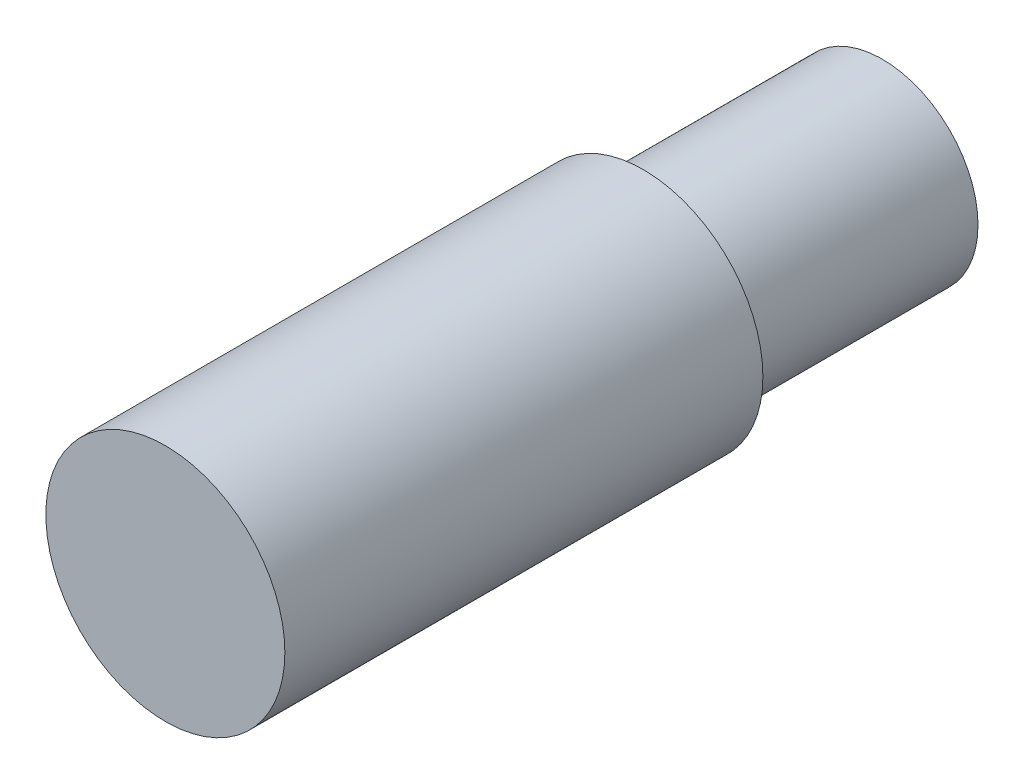
ISO-10303-21;
HEADER;
FILE_DESCRIPTION(('STEP AP214'),'2;1');
FILE_NAME('part.step','',(''),(''),'','','');
FILE_SCHEMA(('AUTOMOTIVE_DESIGN { 1 0 10303 214 1 1 1 1 }'));
ENDSEC;
DATA;
#1=APPLICATION_CONTEXT('core data for automotive mechanical design processes');
#2=APPLICATION_PROTOCOL_DEFINITION('international standard','automotive_design',2000,#1);
#3=PRODUCT_CONTEXT('',#1,'mechanical');
#4=PRODUCT('Part','Part','',(#3));
#5=PRODUCT_RELATED_PRODUCT_CATEGORY('part','',(#4));
#6=PRODUCT_DEFINITION_FORMATION('','',#4);
#7=PRODUCT_DEFINITION_CONTEXT('part definition',#1,'design');
#8=PRODUCT_DEFINITION('design','',#6,#7);
#9=PRODUCT_DEFINITION_SHAPE('','',#8);
#10=(LENGTH_UNIT() NAMED_UNIT(*) SI_UNIT(.MILLI.,.METRE.));
#11=(NAMED_UNIT(*) PLANE_ANGLE_UNIT() SI_UNIT($,.RADIAN.));
#12=(NAMED_UNIT(*) SI_UNIT($,.STERADIAN.) SOLID_ANGLE_UNIT());
#13=UNCERTAINTY_MEASURE_WITH_UNIT(LENGTH_MEASURE(1.E-05),#10,'distance_accuracy_value','');
#14=(GEOMETRIC_REPRESENTATION_CONTEXT(3) GLOBAL_UNCERTAINTY_ASSIGNED_CONTEXT((#13)) GLOBAL_UNIT_ASSIGNED_CONTEXT((#10,
#11,#12)) REPRESENTATION_CONTEXT('',''));
#15=CARTESIAN_POINT('',(0.,0.,0.));
#16=DIRECTION('',(0.,0.,1.));
#17=DIRECTION('',(1.,0.,0.));
#18=AXIS2_PLACEMENT_3D('',#15,#16,#17);
#19=CARTESIAN_POINT('',(0.,0.,5.));
#20=DIRECTION('',(0.,0.,-1.));
#21=DIRECTION('',(-1.,0.,0.));
#22=AXIS2_PLACEMENT_3D('',#19,#20,#21);
#23=CYLINDRICAL_SURFACE('',#22,2.);
#24=CARTESIAN_POINT('',(0.,0.,5.));
#25=DIRECTION('',(0.,0.,1.));
#26=DIRECTION('',(1.,0.,0.));
#27=AXIS2_PLACEMENT_3D('',#24,#25,#26);
#28=CIRCLE('',#27,2.);
#29=CARTESIAN_POINT('',(2.,0.,5.));
#30=VERTEX_POINT('',#29);
#31=EDGE_CURVE('E10',#30,#30,#28,.T.);
#32=ORIENTED_EDGE('',*,*,#31,.F.);
#33=EDGE_LOOP('',(#32));
#34=FACE_BOUND('',#33,.T.);
#35=CARTESIAN_POINT('',(0.,0.,0.));
#36=DIRECTION('',(0.,0.,1.));
#37=DIRECTION('',(1.,0.,0.));
#38=AXIS2_PLACEMENT_3D('',#35,#36,#37);
#39=CIRCLE('',#38,2.);
#40=CARTESIAN_POINT('',(2.,0.,0.));
#41=VERTEX_POINT('',#40);
#42=EDGE_CURVE('E31',#41,#41,#39,.T.);
#43=ORIENTED_EDGE('',*,*,#42,.T.);
#44=EDGE_LOOP('',(#43));
#45=FACE_BOUND('',#44,.T.);
#46=ADVANCED_FACE('F28',(#34,#45),#23,.T.);
#47=CARTESIAN_POINT('',(0.,0.,0.));
#48=DIRECTION('',(0.,0.,1.));
#49=DIRECTION('',(1.,0.,0.));
#50=AXIS2_PLACEMENT_3D('',#47,#48,#49);
#51=PLANE('',#50);
#52=ORIENTED_EDGE('',*,*,#42,.F.);
#53=EDGE_LOOP('',(#52));
#54=FACE_BOUND('',#53,.T.);
#55=ADVANCED_FACE('F56',(#54),#51,.F.);
#56=CARTESIAN_POINT('',(0.,0.,5.));
#57=DIRECTION('',(0.,0.,1.));
#58=DIRECTION('',(1.,0.,0.));
#59=AXIS2_PLACEMENT_3D('',#56,#57,#58);
#60=PLANE('',#59);
#61=CARTESIAN_POINT('',(0.,0.,5.));
#62=DIRECTION('',(0.,0.,1.));
#63=DIRECTION('',(1.,0.,0.));
#64=AXIS2_PLACEMENT_3D('',#61,#62,#63);
#65=CIRCLE('',#64,2.5);
#66=CARTESIAN_POINT('',(2.5,0.,5.));
#67=VERTEX_POINT('',#66);
#68=EDGE_CURVE('E40',#67,#67,#65,.T.);
#69=ORIENTED_EDGE('',*,*,#68,.F.);
#70=EDGE_LOOP('',(#69));
#71=FACE_BOUND('',#70,.T.);
#72=ORIENTED_EDGE('',*,*,#31,.T.);
#73=EDGE_LOOP('',(#72));
#74=FACE_BOUND('',#73,.T.);
#75=ADVANCED_FACE('F51',(#71,#74),#60,.F.);
#76=CARTESIAN_POINT('',(0.,0.,15.));
#77=DIRECTION('',(0.,0.,-1.));
#78=DIRECTION('',(-1.,0.,0.));
#79=AXIS2_PLACEMENT_3D('',#76,#77,#78);
#80=CYLINDRICAL_SURFACE('',#79,2.5);
#81=CARTESIAN_POINT('',(0.,0.,15.));
#82=DIRECTION('',(0.,0.,1.));
#83=DIRECTION('',(1.,0.,0.));
#84=AXIS2_PLACEMENT_3D('',#81,#82,#83);
#85=CIRCLE('',#84,2.5);
#86=CARTESIAN_POINT('',(2.5,0.,15.));
#87=VERTEX_POINT('',#86);
#88=EDGE_CURVE('E38',#87,#87,#85,.T.);
#89=ORIENTED_EDGE('',*,*,#88,.F.);
#90=EDGE_LOOP('',(#89));
#91=FACE_BOUND('',#90,.T.);
#92=ORIENTED_EDGE('',*,*,#68,.T.);
#93=EDGE_LOOP('',(#92));
#94=FACE_BOUND('',#93,.T.);
#95=ADVANCED_FACE('F48',(#91,#94),#80,.T.);
#96=CARTESIAN_POINT('',(0.,0.,15.));
#97=DIRECTION('',(0.,0.,1.));
#98=DIRECTION('',(1.,0.,0.));
#99=AXIS2_PLACEMENT_3D('',#96,#97,#98);
#100=PLANE('',#99);
#101=ORIENTED_EDGE('',*,*,#88,.T.);
#102=EDGE_LOOP('',(#101));
#103=FACE_BOUND('',#102,.T.);
#104=ADVANCED_FACE('F46',(#103),#100,.T.);
#105=CLOSED_SHELL('',(#46,#55,#75,#95,#104));
#106=MANIFOLD_SOLID_BREP('B2',#105);
#107=ADVANCED_BREP_SHAPE_REPRESENTATION('',(#18,#106),#14);
#108=SHAPE_DEFINITION_REPRESENTATION(#9,#107);
ENDSEC;
END-ISO-10303-21;
